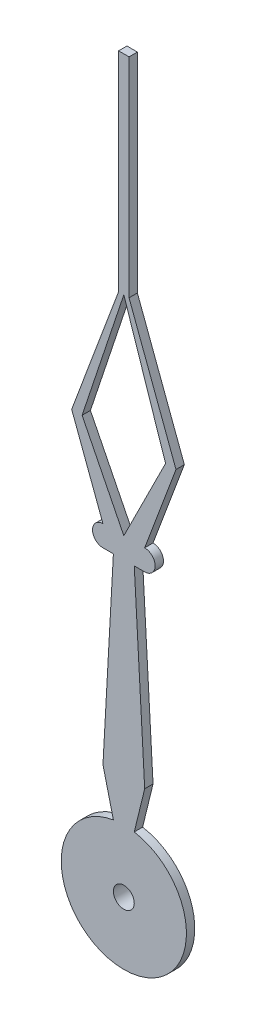
ISO-10303-21;
HEADER;
FILE_DESCRIPTION(('STEP AP214'),'2;1');
FILE_NAME('part.step','',(''),(''),'','','');
FILE_SCHEMA(('AUTOMOTIVE_DESIGN { 1 0 10303 214 1 1 1 1 }'));
ENDSEC;
DATA;
#1=APPLICATION_CONTEXT('core data for automotive mechanical design processes');
#2=APPLICATION_PROTOCOL_DEFINITION('international standard','automotive_design',2000,#1);
#3=PRODUCT_CONTEXT('',#1,'mechanical');
#4=PRODUCT('Part','Part','',(#3));
#5=PRODUCT_RELATED_PRODUCT_CATEGORY('part','',(#4));
#6=PRODUCT_DEFINITION_FORMATION('','',#4);
#7=PRODUCT_DEFINITION_CONTEXT('part definition',#1,'design');
#8=PRODUCT_DEFINITION('design','',#6,#7);
#9=PRODUCT_DEFINITION_SHAPE('','',#8);
#10=(LENGTH_UNIT() NAMED_UNIT(*) SI_UNIT(.MILLI.,.METRE.));
#11=(NAMED_UNIT(*) PLANE_ANGLE_UNIT() SI_UNIT($,.RADIAN.));
#12=(NAMED_UNIT(*) SI_UNIT($,.STERADIAN.) SOLID_ANGLE_UNIT());
#13=UNCERTAINTY_MEASURE_WITH_UNIT(LENGTH_MEASURE(1.E-05),#10,'distance_accuracy_value','');
#14=(GEOMETRIC_REPRESENTATION_CONTEXT(3) GLOBAL_UNCERTAINTY_ASSIGNED_CONTEXT((#13)) GLOBAL_UNIT_ASSIGNED_CONTEXT((#10,
#11,#12)) REPRESENTATION_CONTEXT('',''));
#15=CARTESIAN_POINT('',(0.,0.,0.));
#16=DIRECTION('',(0.,0.,1.));
#17=DIRECTION('',(1.,0.,0.));
#18=AXIS2_PLACEMENT_3D('',#15,#16,#17);
#19=CARTESIAN_POINT('',(0.,0.,0.));
#20=DIRECTION('',(0.,0.,1.));
#21=DIRECTION('',(1.,0.,0.));
#22=AXIS2_PLACEMENT_3D('',#19,#20,#21);
#23=PLANE('',#22);
#24=DIRECTION('',(0.447213595499958,0.894427190999916,0.));
#25=VECTOR('',#24,1.);
#26=CARTESIAN_POINT('',(0.,7.5,0.));
#27=LINE('',#26,#25);
#28=CARTESIAN_POINT('',(0.,7.5,0.));
#29=VERTEX_POINT('',#28);
#30=CARTESIAN_POINT('',(1.,9.5,0.));
#31=VERTEX_POINT('',#30);
#32=EDGE_CURVE('E59',#29,#31,#27,.T.);
#33=ORIENTED_EDGE('',*,*,#32,.T.);
#34=DIRECTION('',(-0.316227766016838,0.948683298050514,0.));
#35=VECTOR('',#34,1.);
#36=CARTESIAN_POINT('',(0.,12.5,0.));
#37=LINE('',#36,#35);
#38=CARTESIAN_POINT('',(0.,12.5,0.));
#39=VERTEX_POINT('',#38);
#40=EDGE_CURVE('E188',#31,#39,#37,.T.);
#41=ORIENTED_EDGE('',*,*,#40,.T.);
#42=DIRECTION('',(-0.316227766016838,-0.948683298050514,0.));
#43=VECTOR('',#42,1.);
#44=CARTESIAN_POINT('',(-1.,9.5,0.));
#45=LINE('',#44,#43);
#46=CARTESIAN_POINT('',(-1.,9.5,0.));
#47=VERTEX_POINT('',#46);
#48=EDGE_CURVE('E204',#39,#47,#45,.T.);
#49=ORIENTED_EDGE('',*,*,#48,.T.);
#50=DIRECTION('',(0.447213595499958,-0.894427190999916,0.));
#51=VECTOR('',#50,1.);
#52=CARTESIAN_POINT('',(0.,7.5,0.));
#53=LINE('',#52,#51);
#54=EDGE_CURVE('E182',#47,#29,#53,.T.);
#55=ORIENTED_EDGE('',*,*,#54,.T.);
#56=EDGE_LOOP('',(#33,#41,#49,#55));
#57=FACE_BOUND('',#56,.T.);
#58=CARTESIAN_POINT('',(0.,0.,0.));
#59=DIRECTION('',(0.,0.,1.));
#60=DIRECTION('',(1.,0.,0.));
#61=AXIS2_PLACEMENT_3D('',#58,#59,#60);
#62=CIRCLE('',#61,1.5);
#63=CARTESIAN_POINT('',(-0.25,1.4790199457749,0.));
#64=VERTEX_POINT('',#63);
#65=CARTESIAN_POINT('',(0.25,1.4790199457749,0.));
#66=VERTEX_POINT('',#65);
#67=EDGE_CURVE('E214',#64,#66,#62,.T.);
#68=ORIENTED_EDGE('',*,*,#67,.F.);
#69=DIRECTION('',(0.237836479973025,-0.97130520887826,0.));
#70=VECTOR('',#69,1.);
#71=CARTESIAN_POINT('',(-0.25,1.4790199457749,0.));
#72=LINE('',#71,#70);
#73=CARTESIAN_POINT('',(-0.5,2.5,0.));
#74=VERTEX_POINT('',#73);
#75=EDGE_CURVE('E219',#74,#64,#72,.T.);
#76=ORIENTED_EDGE('',*,*,#75,.F.);
#77=DIRECTION('',(-0.055470019622523,-0.998460353205412,0.));
#78=VECTOR('',#77,1.);
#79=CARTESIAN_POINT('',(-0.5,2.5,0.));
#80=LINE('',#79,#78);
#81=CARTESIAN_POINT('',(-0.25,7.,0.));
#82=VERTEX_POINT('',#81);
#83=EDGE_CURVE('E278',#82,#74,#80,.T.);
#84=ORIENTED_EDGE('',*,*,#83,.F.);
#85=DIRECTION('',(1.,0.,0.));
#86=VECTOR('',#85,1.);
#87=CARTESIAN_POINT('',(-0.5,7.,0.));
#88=LINE('',#87,#86);
#89=CARTESIAN_POINT('',(-0.5,7.,0.));
#90=VERTEX_POINT('',#89);
#91=EDGE_CURVE('E276',#90,#82,#88,.T.);
#92=ORIENTED_EDGE('',*,*,#91,.F.);
#93=CARTESIAN_POINT('',(-0.5,7.25,0.));
#94=DIRECTION('',(0.,0.,1.));
#95=DIRECTION('',(-1.,0.,0.));
#96=AXIS2_PLACEMENT_3D('',#93,#94,#95);
#97=CIRCLE('',#96,0.25);
#98=CARTESIAN_POINT('',(-0.5,7.5,0.));
#99=VERTEX_POINT('',#98);
#100=EDGE_CURVE('E274',#99,#90,#97,.T.);
#101=ORIENTED_EDGE('',*,*,#100,.F.);
#102=DIRECTION('',(0.351123441588392,-0.936329177569044,0.));
#103=VECTOR('',#102,1.);
#104=CARTESIAN_POINT('',(-0.5,7.5,0.));
#105=LINE('',#104,#103);
#106=CARTESIAN_POINT('',(-1.25,9.5,0.));
#107=VERTEX_POINT('',#106);
#108=EDGE_CURVE('E272',#107,#99,#105,.T.);
#109=ORIENTED_EDGE('',*,*,#108,.F.);
#110=DIRECTION('',(-0.351123441588392,-0.936329177569044,0.));
#111=VECTOR('',#110,1.);
#112=CARTESIAN_POINT('',(-1.25,9.5,0.));
#113=LINE('',#112,#111);
#114=CARTESIAN_POINT('',(-0.125,12.5,0.));
#115=VERTEX_POINT('',#114);
#116=EDGE_CURVE('E270',#115,#107,#113,.T.);
#117=ORIENTED_EDGE('',*,*,#116,.F.);
#118=DIRECTION('',(0.,-1.,0.));
#119=VECTOR('',#118,1.);
#120=CARTESIAN_POINT('',(-0.125000000000001,17.5,0.));
#121=LINE('',#120,#119);
#122=CARTESIAN_POINT('',(-0.125000000000001,17.5,0.));
#123=VERTEX_POINT('',#122);
#124=EDGE_CURVE('E268',#123,#115,#121,.T.);
#125=ORIENTED_EDGE('',*,*,#124,.F.);
#126=DIRECTION('',(-1.,0.,0.));
#127=VECTOR('',#126,1.);
#128=CARTESIAN_POINT('',(0.125,17.5,0.));
#129=LINE('',#128,#127);
#130=CARTESIAN_POINT('',(0.125,17.5,0.));
#131=VERTEX_POINT('',#130);
#132=EDGE_CURVE('E266',#131,#123,#129,.T.);
#133=ORIENTED_EDGE('',*,*,#132,.F.);
#134=DIRECTION('',(0.,1.,0.));
#135=VECTOR('',#134,1.);
#136=CARTESIAN_POINT('',(0.125,12.5,0.));
#137=LINE('',#136,#135);
#138=CARTESIAN_POINT('',(0.125,12.5,0.));
#139=VERTEX_POINT('',#138);
#140=EDGE_CURVE('E264',#139,#131,#137,.T.);
#141=ORIENTED_EDGE('',*,*,#140,.F.);
#142=DIRECTION('',(-0.351123441588392,0.936329177569044,0.));
#143=VECTOR('',#142,1.);
#144=CARTESIAN_POINT('',(1.25,9.5,0.));
#145=LINE('',#144,#143);
#146=CARTESIAN_POINT('',(1.25,9.5,0.));
#147=VERTEX_POINT('',#146);
#148=EDGE_CURVE('E262',#147,#139,#145,.T.);
#149=ORIENTED_EDGE('',*,*,#148,.F.);
#150=DIRECTION('',(0.351123441588392,0.936329177569044,0.));
#151=VECTOR('',#150,1.);
#152=CARTESIAN_POINT('',(0.5,7.5,0.));
#153=LINE('',#152,#151);
#154=CARTESIAN_POINT('',(0.5,7.5,0.));
#155=VERTEX_POINT('',#154);
#156=EDGE_CURVE('E260',#155,#147,#153,.T.);
#157=ORIENTED_EDGE('',*,*,#156,.F.);
#158=CARTESIAN_POINT('',(0.5,7.25,0.));
#159=DIRECTION('',(0.,0.,1.));
#160=DIRECTION('',(1.,0.,0.));
#161=AXIS2_PLACEMENT_3D('',#158,#159,#160);
#162=CIRCLE('',#161,0.250000000000001);
#163=CARTESIAN_POINT('',(0.5,7.,0.));
#164=VERTEX_POINT('',#163);
#165=EDGE_CURVE('E258',#164,#155,#162,.T.);
#166=ORIENTED_EDGE('',*,*,#165,.F.);
#167=DIRECTION('',(1.,0.,0.));
#168=VECTOR('',#167,1.);
#169=CARTESIAN_POINT('',(0.25,7.,0.));
#170=LINE('',#169,#168);
#171=CARTESIAN_POINT('',(0.25,7.,0.));
#172=VERTEX_POINT('',#171);
#173=EDGE_CURVE('E256',#172,#164,#170,.T.);
#174=ORIENTED_EDGE('',*,*,#173,.F.);
#175=DIRECTION('',(-0.0554700196225229,0.998460353205412,0.));
#176=VECTOR('',#175,1.);
#177=CARTESIAN_POINT('',(0.25,7.,0.));
#178=LINE('',#177,#176);
#179=CARTESIAN_POINT('',(0.5,2.5,0.));
#180=VERTEX_POINT('',#179);
#181=EDGE_CURVE('E254',#180,#172,#178,.T.);
#182=ORIENTED_EDGE('',*,*,#181,.F.);
#183=DIRECTION('',(0.237836479973025,0.97130520887826,0.));
#184=VECTOR('',#183,1.);
#185=CARTESIAN_POINT('',(0.5,2.5,0.));
#186=LINE('',#185,#184);
#187=EDGE_CURVE('E252',#66,#180,#186,.T.);
#188=ORIENTED_EDGE('',*,*,#187,.F.);
#189=EDGE_LOOP('',(#68,#76,#84,#92,#101,#109,#117,#125,#133,#141,#149,#157,#166,#174,#182,#188));
#190=FACE_BOUND('',#189,.T.);
#191=CARTESIAN_POINT('',(0.,0.,0.));
#192=DIRECTION('',(0.,0.,1.));
#193=DIRECTION('',(1.,0.,0.));
#194=AXIS2_PLACEMENT_3D('',#191,#192,#193);
#195=CIRCLE('',#194,0.5);
#196=CARTESIAN_POINT('',(0.5,0.,0.));
#197=VERTEX_POINT('',#196);
#198=EDGE_CURVE('E11',#197,#197,#195,.F.);
#199=ORIENTED_EDGE('',*,*,#198,.F.);
#200=EDGE_LOOP('',(#199));
#201=FACE_BOUND('',#200,.T.);
#202=ADVANCED_FACE('F36',(#57,#190,#201),#23,.F.);
#203=CARTESIAN_POINT('',(0.,0.,0.2));
#204=DIRECTION('',(0.,0.,1.));
#205=DIRECTION('',(1.,0.,0.));
#206=AXIS2_PLACEMENT_3D('',#203,#204,#205);
#207=PLANE('',#206);
#208=CARTESIAN_POINT('',(0.,0.,0.2));
#209=DIRECTION('',(0.,0.,1.));
#210=DIRECTION('',(1.,0.,0.));
#211=AXIS2_PLACEMENT_3D('',#208,#209,#210);
#212=CIRCLE('',#211,0.25);
#213=CARTESIAN_POINT('',(0.25,0.,0.2));
#214=VERTEX_POINT('',#213);
#215=EDGE_CURVE('E189',#214,#214,#212,.T.);
#216=ORIENTED_EDGE('',*,*,#215,.F.);
#217=EDGE_LOOP('',(#216));
#218=FACE_BOUND('',#217,.T.);
#219=CARTESIAN_POINT('',(0.,0.,0.2));
#220=DIRECTION('',(0.,0.,1.));
#221=DIRECTION('',(1.,0.,0.));
#222=AXIS2_PLACEMENT_3D('',#219,#220,#221);
#223=CIRCLE('',#222,1.5);
#224=CARTESIAN_POINT('',(-0.25,1.4790199457749,0.2));
#225=VERTEX_POINT('',#224);
#226=CARTESIAN_POINT('',(0.25,1.4790199457749,0.2));
#227=VERTEX_POINT('',#226);
#228=EDGE_CURVE('E215',#225,#227,#223,.T.);
#229=ORIENTED_EDGE('',*,*,#228,.T.);
#230=DIRECTION('',(0.237836479973025,0.97130520887826,0.));
#231=VECTOR('',#230,1.);
#232=CARTESIAN_POINT('',(0.5,2.5,0.2));
#233=LINE('',#232,#231);
#234=CARTESIAN_POINT('',(0.5,2.5,0.2));
#235=VERTEX_POINT('',#234);
#236=EDGE_CURVE('E218',#227,#235,#233,.T.);
#237=ORIENTED_EDGE('',*,*,#236,.T.);
#238=DIRECTION('',(-0.0554700196225229,0.998460353205412,0.));
#239=VECTOR('',#238,1.);
#240=CARTESIAN_POINT('',(0.25,7.,0.2));
#241=LINE('',#240,#239);
#242=CARTESIAN_POINT('',(0.25,7.,0.2));
#243=VERTEX_POINT('',#242);
#244=EDGE_CURVE('E221',#235,#243,#241,.T.);
#245=ORIENTED_EDGE('',*,*,#244,.T.);
#246=DIRECTION('',(1.,0.,0.));
#247=VECTOR('',#246,1.);
#248=CARTESIAN_POINT('',(0.25,7.,0.2));
#249=LINE('',#248,#247);
#250=CARTESIAN_POINT('',(0.5,7.,0.2));
#251=VERTEX_POINT('',#250);
#252=EDGE_CURVE('E223',#243,#251,#249,.T.);
#253=ORIENTED_EDGE('',*,*,#252,.T.);
#254=CARTESIAN_POINT('',(0.5,7.25,0.2));
#255=DIRECTION('',(0.,0.,1.));
#256=DIRECTION('',(1.,0.,0.));
#257=AXIS2_PLACEMENT_3D('',#254,#255,#256);
#258=CIRCLE('',#257,0.250000000000001);
#259=CARTESIAN_POINT('',(0.5,7.5,0.2));
#260=VERTEX_POINT('',#259);
#261=EDGE_CURVE('E225',#251,#260,#258,.T.);
#262=ORIENTED_EDGE('',*,*,#261,.T.);
#263=DIRECTION('',(0.351123441588392,0.936329177569044,0.));
#264=VECTOR('',#263,1.);
#265=CARTESIAN_POINT('',(0.5,7.5,0.2));
#266=LINE('',#265,#264);
#267=CARTESIAN_POINT('',(1.25,9.5,0.2));
#268=VERTEX_POINT('',#267);
#269=EDGE_CURVE('E227',#260,#268,#266,.T.);
#270=ORIENTED_EDGE('',*,*,#269,.T.);
#271=DIRECTION('',(-0.351123441588392,0.936329177569044,0.));
#272=VECTOR('',#271,1.);
#273=CARTESIAN_POINT('',(1.25,9.5,0.2));
#274=LINE('',#273,#272);
#275=CARTESIAN_POINT('',(0.125,12.5,0.2));
#276=VERTEX_POINT('',#275);
#277=EDGE_CURVE('E229',#268,#276,#274,.T.);
#278=ORIENTED_EDGE('',*,*,#277,.T.);
#279=DIRECTION('',(0.,1.,0.));
#280=VECTOR('',#279,1.);
#281=CARTESIAN_POINT('',(0.125,12.5,0.2));
#282=LINE('',#281,#280);
#283=CARTESIAN_POINT('',(0.125,17.5,0.2));
#284=VERTEX_POINT('',#283);
#285=EDGE_CURVE('E231',#276,#284,#282,.T.);
#286=ORIENTED_EDGE('',*,*,#285,.T.);
#287=DIRECTION('',(-1.,0.,0.));
#288=VECTOR('',#287,1.);
#289=CARTESIAN_POINT('',(0.125,17.5,0.2));
#290=LINE('',#289,#288);
#291=CARTESIAN_POINT('',(-0.125000000000001,17.5,0.2));
#292=VERTEX_POINT('',#291);
#293=EDGE_CURVE('E233',#284,#292,#290,.T.);
#294=ORIENTED_EDGE('',*,*,#293,.T.);
#295=DIRECTION('',(0.,-1.,0.));
#296=VECTOR('',#295,1.);
#297=CARTESIAN_POINT('',(-0.125000000000001,17.5,0.2));
#298=LINE('',#297,#296);
#299=CARTESIAN_POINT('',(-0.125,12.5,0.2));
#300=VERTEX_POINT('',#299);
#301=EDGE_CURVE('E235',#292,#300,#298,.T.);
#302=ORIENTED_EDGE('',*,*,#301,.T.);
#303=DIRECTION('',(-0.351123441588392,-0.936329177569044,0.));
#304=VECTOR('',#303,1.);
#305=CARTESIAN_POINT('',(-1.25,9.5,0.2));
#306=LINE('',#305,#304);
#307=CARTESIAN_POINT('',(-1.25,9.5,0.2));
#308=VERTEX_POINT('',#307);
#309=EDGE_CURVE('E237',#300,#308,#306,.T.);
#310=ORIENTED_EDGE('',*,*,#309,.T.);
#311=DIRECTION('',(0.351123441588392,-0.936329177569044,0.));
#312=VECTOR('',#311,1.);
#313=CARTESIAN_POINT('',(-0.5,7.5,0.2));
#314=LINE('',#313,#312);
#315=CARTESIAN_POINT('',(-0.5,7.5,0.2));
#316=VERTEX_POINT('',#315);
#317=EDGE_CURVE('E239',#308,#316,#314,.T.);
#318=ORIENTED_EDGE('',*,*,#317,.T.);
#319=CARTESIAN_POINT('',(-0.5,7.25,0.2));
#320=DIRECTION('',(0.,0.,1.));
#321=DIRECTION('',(-1.,0.,0.));
#322=AXIS2_PLACEMENT_3D('',#319,#320,#321);
#323=CIRCLE('',#322,0.25);
#324=CARTESIAN_POINT('',(-0.5,7.,0.2));
#325=VERTEX_POINT('',#324);
#326=EDGE_CURVE('E241',#316,#325,#323,.T.);
#327=ORIENTED_EDGE('',*,*,#326,.T.);
#328=DIRECTION('',(1.,0.,0.));
#329=VECTOR('',#328,1.);
#330=CARTESIAN_POINT('',(-0.5,7.,0.2));
#331=LINE('',#330,#329);
#332=CARTESIAN_POINT('',(-0.25,7.,0.2));
#333=VERTEX_POINT('',#332);
#334=EDGE_CURVE('E243',#325,#333,#331,.T.);
#335=ORIENTED_EDGE('',*,*,#334,.T.);
#336=DIRECTION('',(-0.055470019622523,-0.998460353205412,0.));
#337=VECTOR('',#336,1.);
#338=CARTESIAN_POINT('',(-0.5,2.5,0.2));
#339=LINE('',#338,#337);
#340=CARTESIAN_POINT('',(-0.5,2.5,0.2));
#341=VERTEX_POINT('',#340);
#342=EDGE_CURVE('E245',#333,#341,#339,.T.);
#343=ORIENTED_EDGE('',*,*,#342,.T.);
#344=DIRECTION('',(0.237836479973025,-0.97130520887826,0.));
#345=VECTOR('',#344,1.);
#346=CARTESIAN_POINT('',(-0.25,1.4790199457749,0.2));
#347=LINE('',#346,#345);
#348=EDGE_CURVE('E247',#341,#225,#347,.T.);
#349=ORIENTED_EDGE('',*,*,#348,.T.);
#350=EDGE_LOOP('',(#229,#237,#245,#253,#262,#270,#278,#286,#294,#302,#310,#318,#327,#335,#343,#349));
#351=FACE_BOUND('',#350,.T.);
#352=DIRECTION('',(-0.316227766016838,0.948683298050514,0.));
#353=VECTOR('',#352,1.);
#354=CARTESIAN_POINT('',(0.,12.5,0.2));
#355=LINE('',#354,#353);
#356=CARTESIAN_POINT('',(1.,9.5,0.2));
#357=VERTEX_POINT('',#356);
#358=CARTESIAN_POINT('',(0.,12.5,0.2));
#359=VERTEX_POINT('',#358);
#360=EDGE_CURVE('E181',#357,#359,#355,.T.);
#361=ORIENTED_EDGE('',*,*,#360,.F.);
#362=DIRECTION('',(0.447213595499958,0.894427190999916,0.));
#363=VECTOR('',#362,1.);
#364=CARTESIAN_POINT('',(0.,7.5,0.2));
#365=LINE('',#364,#363);
#366=CARTESIAN_POINT('',(0.,7.5,0.2));
#367=VERTEX_POINT('',#366);
#368=EDGE_CURVE('E173',#367,#357,#365,.T.);
#369=ORIENTED_EDGE('',*,*,#368,.F.);
#370=DIRECTION('',(0.447213595499958,-0.894427190999916,0.));
#371=VECTOR('',#370,1.);
#372=CARTESIAN_POINT('',(0.,7.5,0.2));
#373=LINE('',#372,#371);
#374=CARTESIAN_POINT('',(-1.,9.5,0.2));
#375=VERTEX_POINT('',#374);
#376=EDGE_CURVE('E196',#375,#367,#373,.T.);
#377=ORIENTED_EDGE('',*,*,#376,.F.);
#378=DIRECTION('',(-0.316227766016838,-0.948683298050514,0.));
#379=VECTOR('',#378,1.);
#380=CARTESIAN_POINT('',(-1.,9.5,0.2));
#381=LINE('',#380,#379);
#382=EDGE_CURVE('E194',#359,#375,#381,.T.);
#383=ORIENTED_EDGE('',*,*,#382,.F.);
#384=EDGE_LOOP('',(#361,#369,#377,#383));
#385=FACE_BOUND('',#384,.T.);
#386=ADVANCED_FACE('F193',(#218,#351,#385),#207,.T.);
#387=CARTESIAN_POINT('',(0.,0.,0.2));
#388=DIRECTION('',(0.,0.,-1.));
#389=DIRECTION('',(-1.,0.,0.));
#390=AXIS2_PLACEMENT_3D('',#387,#388,#389);
#391=CYLINDRICAL_SURFACE('',#390,1.5);
#392=ORIENTED_EDGE('',*,*,#67,.T.);
#393=DIRECTION('',(0.,0.,-1.));
#394=VECTOR('',#393,1.);
#395=CARTESIAN_POINT('',(0.25,1.4790199457749,0.2));
#396=LINE('',#395,#394);
#397=EDGE_CURVE('E44',#227,#66,#396,.T.);
#398=ORIENTED_EDGE('',*,*,#397,.F.);
#399=ORIENTED_EDGE('',*,*,#228,.F.);
#400=DIRECTION('',(0.,0.,-1.));
#401=VECTOR('',#400,1.);
#402=CARTESIAN_POINT('',(-0.25,1.4790199457749,0.2));
#403=LINE('',#402,#401);
#404=EDGE_CURVE('E249',#225,#64,#403,.T.);
#405=ORIENTED_EDGE('',*,*,#404,.T.);
#406=EDGE_LOOP('',(#392,#398,#399,#405));
#407=FACE_BOUND('',#406,.T.);
#408=ADVANCED_FACE('F38',(#407),#391,.T.);
#409=CARTESIAN_POINT('',(0.5,2.5,0.2));
#410=DIRECTION('',(-0.97130520887826,0.237836479973025,0.));
#411=DIRECTION('',(-0.237836479973025,-0.971305208878261,0.));
#412=AXIS2_PLACEMENT_3D('',#409,#410,#411);
#413=PLANE('',#412);
#414=ORIENTED_EDGE('',*,*,#187,.T.);
#415=DIRECTION('',(0.,0.,-1.));
#416=VECTOR('',#415,1.);
#417=CARTESIAN_POINT('',(0.5,2.5,0.2));
#418=LINE('',#417,#416);
#419=EDGE_CURVE('E322',#235,#180,#418,.T.);
#420=ORIENTED_EDGE('',*,*,#419,.F.);
#421=ORIENTED_EDGE('',*,*,#236,.F.);
#422=ORIENTED_EDGE('',*,*,#397,.T.);
#423=EDGE_LOOP('',(#414,#420,#421,#422));
#424=FACE_BOUND('',#423,.T.);
#425=ADVANCED_FACE('F327',(#424),#413,.F.);
#426=CARTESIAN_POINT('',(0.25,7.,0.2));
#427=DIRECTION('',(-0.998460353205412,-0.0554700196225229,0.));
#428=DIRECTION('',(0.0554700196225229,-0.998460353205412,0.));
#429=AXIS2_PLACEMENT_3D('',#426,#427,#428);
#430=PLANE('',#429);
#431=ORIENTED_EDGE('',*,*,#181,.T.);
#432=DIRECTION('',(0.,0.,-1.));
#433=VECTOR('',#432,1.);
#434=CARTESIAN_POINT('',(0.25,7.,0.2));
#435=LINE('',#434,#433);
#436=EDGE_CURVE('E319',#243,#172,#435,.T.);
#437=ORIENTED_EDGE('',*,*,#436,.F.);
#438=ORIENTED_EDGE('',*,*,#244,.F.);
#439=ORIENTED_EDGE('',*,*,#419,.T.);
#440=EDGE_LOOP('',(#431,#437,#438,#439));
#441=FACE_BOUND('',#440,.T.);
#442=ADVANCED_FACE('F342',(#441),#430,.F.);
#443=CARTESIAN_POINT('',(0.25,7.,0.2));
#444=DIRECTION('',(0.,1.,0.));
#445=DIRECTION('',(-1.,0.,0.));
#446=AXIS2_PLACEMENT_3D('',#443,#444,#445);
#447=PLANE('',#446);
#448=ORIENTED_EDGE('',*,*,#173,.T.);
#449=DIRECTION('',(0.,0.,-1.));
#450=VECTOR('',#449,1.);
#451=CARTESIAN_POINT('',(0.5,7.,0.2));
#452=LINE('',#451,#450);
#453=EDGE_CURVE('E316',#251,#164,#452,.T.);
#454=ORIENTED_EDGE('',*,*,#453,.F.);
#455=ORIENTED_EDGE('',*,*,#252,.F.);
#456=ORIENTED_EDGE('',*,*,#436,.T.);
#457=EDGE_LOOP('',(#448,#454,#455,#456));
#458=FACE_BOUND('',#457,.T.);
#459=ADVANCED_FACE('F346',(#458),#447,.F.);
#460=CARTESIAN_POINT('',(0.5,7.25,0.2));
#461=DIRECTION('',(0.,0.,-1.));
#462=DIRECTION('',(-1.,0.,0.));
#463=AXIS2_PLACEMENT_3D('',#460,#461,#462);
#464=CYLINDRICAL_SURFACE('',#463,0.250000000000001);
#465=ORIENTED_EDGE('',*,*,#165,.T.);
#466=DIRECTION('',(0.,0.,-1.));
#467=VECTOR('',#466,1.);
#468=CARTESIAN_POINT('',(0.5,7.5,0.2));
#469=LINE('',#468,#467);
#470=EDGE_CURVE('E313',#260,#155,#469,.T.);
#471=ORIENTED_EDGE('',*,*,#470,.F.);
#472=ORIENTED_EDGE('',*,*,#261,.F.);
#473=ORIENTED_EDGE('',*,*,#453,.T.);
#474=EDGE_LOOP('',(#465,#471,#472,#473));
#475=FACE_BOUND('',#474,.T.);
#476=ADVANCED_FACE('F404',(#475),#464,.T.);
#477=CARTESIAN_POINT('',(0.5,7.5,0.2));
#478=DIRECTION('',(-0.936329177569044,0.351123441588392,0.));
#479=DIRECTION('',(-0.351123441588392,-0.936329177569045,0.));
#480=AXIS2_PLACEMENT_3D('',#477,#478,#479);
#481=PLANE('',#480);
#482=ORIENTED_EDGE('',*,*,#156,.T.);
#483=DIRECTION('',(0.,0.,-1.));
#484=VECTOR('',#483,1.);
#485=CARTESIAN_POINT('',(1.25,9.5,0.2));
#486=LINE('',#485,#484);
#487=EDGE_CURVE('E310',#268,#147,#486,.T.);
#488=ORIENTED_EDGE('',*,*,#487,.F.);
#489=ORIENTED_EDGE('',*,*,#269,.F.);
#490=ORIENTED_EDGE('',*,*,#470,.T.);
#491=EDGE_LOOP('',(#482,#488,#489,#490));
#492=FACE_BOUND('',#491,.T.);
#493=ADVANCED_FACE('F402',(#492),#481,.F.);
#494=CARTESIAN_POINT('',(1.25,9.5,0.2));
#495=DIRECTION('',(-0.936329177569045,-0.351123441588392,0.));
#496=DIRECTION('',(0.351123441588392,-0.936329177569045,0.));
#497=AXIS2_PLACEMENT_3D('',#494,#495,#496);
#498=PLANE('',#497);
#499=ORIENTED_EDGE('',*,*,#148,.T.);
#500=DIRECTION('',(0.,0.,-1.));
#501=VECTOR('',#500,1.);
#502=CARTESIAN_POINT('',(0.125,12.5,0.2));
#503=LINE('',#502,#501);
#504=EDGE_CURVE('E307',#276,#139,#503,.T.);
#505=ORIENTED_EDGE('',*,*,#504,.F.);
#506=ORIENTED_EDGE('',*,*,#277,.F.);
#507=ORIENTED_EDGE('',*,*,#487,.T.);
#508=EDGE_LOOP('',(#499,#505,#506,#507));
#509=FACE_BOUND('',#508,.T.);
#510=ADVANCED_FACE('F398',(#509),#498,.F.);
#511=CARTESIAN_POINT('',(0.125,12.5,0.2));
#512=DIRECTION('',(-1.,0.,0.));
#513=DIRECTION('',(0.,0.,1.));
#514=AXIS2_PLACEMENT_3D('',#511,#512,#513);
#515=PLANE('',#514);
#516=ORIENTED_EDGE('',*,*,#140,.T.);
#517=DIRECTION('',(0.,0.,-1.));
#518=VECTOR('',#517,1.);
#519=CARTESIAN_POINT('',(0.125,17.5,0.2));
#520=LINE('',#519,#518);
#521=EDGE_CURVE('E304',#284,#131,#520,.T.);
#522=ORIENTED_EDGE('',*,*,#521,.F.);
#523=ORIENTED_EDGE('',*,*,#285,.F.);
#524=ORIENTED_EDGE('',*,*,#504,.T.);
#525=EDGE_LOOP('',(#516,#522,#523,#524));
#526=FACE_BOUND('',#525,.T.);
#527=ADVANCED_FACE('F393',(#526),#515,.F.);
#528=CARTESIAN_POINT('',(0.125,17.5,0.2));
#529=DIRECTION('',(0.,-1.,0.));
#530=DIRECTION('',(0.,0.,-1.));
#531=AXIS2_PLACEMENT_3D('',#528,#529,#530);
#532=PLANE('',#531);
#533=ORIENTED_EDGE('',*,*,#132,.T.);
#534=DIRECTION('',(0.,0.,-1.));
#535=VECTOR('',#534,1.);
#536=CARTESIAN_POINT('',(-0.125000000000001,17.5,0.2));
#537=LINE('',#536,#535);
#538=EDGE_CURVE('E301',#292,#123,#537,.T.);
#539=ORIENTED_EDGE('',*,*,#538,.F.);
#540=ORIENTED_EDGE('',*,*,#293,.F.);
#541=ORIENTED_EDGE('',*,*,#521,.T.);
#542=EDGE_LOOP('',(#533,#539,#540,#541));
#543=FACE_BOUND('',#542,.T.);
#544=ADVANCED_FACE('F387',(#543),#532,.F.);
#545=CARTESIAN_POINT('',(-0.125000000000001,17.5,0.2));
#546=DIRECTION('',(1.,0.,0.));
#547=DIRECTION('',(0.,1.,0.));
#548=AXIS2_PLACEMENT_3D('',#545,#546,#547);
#549=PLANE('',#548);
#550=ORIENTED_EDGE('',*,*,#124,.T.);
#551=DIRECTION('',(0.,0.,-1.));
#552=VECTOR('',#551,1.);
#553=CARTESIAN_POINT('',(-0.125,12.5,0.2));
#554=LINE('',#553,#552);
#555=EDGE_CURVE('E298',#300,#115,#554,.T.);
#556=ORIENTED_EDGE('',*,*,#555,.F.);
#557=ORIENTED_EDGE('',*,*,#301,.F.);
#558=ORIENTED_EDGE('',*,*,#538,.T.);
#559=EDGE_LOOP('',(#550,#556,#557,#558));
#560=FACE_BOUND('',#559,.T.);
#561=ADVANCED_FACE('F383',(#560),#549,.F.);
#562=CARTESIAN_POINT('',(-1.25,9.5,0.2));
#563=DIRECTION('',(0.936329177569045,-0.351123441588392,0.));
#564=DIRECTION('',(0.351123441588392,0.936329177569045,0.));
#565=AXIS2_PLACEMENT_3D('',#562,#563,#564);
#566=PLANE('',#565);
#567=ORIENTED_EDGE('',*,*,#116,.T.);
#568=DIRECTION('',(0.,0.,-1.));
#569=VECTOR('',#568,1.);
#570=CARTESIAN_POINT('',(-1.25,9.5,0.2));
#571=LINE('',#570,#569);
#572=EDGE_CURVE('E295',#308,#107,#571,.T.);
#573=ORIENTED_EDGE('',*,*,#572,.F.);
#574=ORIENTED_EDGE('',*,*,#309,.F.);
#575=ORIENTED_EDGE('',*,*,#555,.T.);
#576=EDGE_LOOP('',(#567,#573,#574,#575));
#577=FACE_BOUND('',#576,.T.);
#578=ADVANCED_FACE('F378',(#577),#566,.F.);
#579=CARTESIAN_POINT('',(-0.5,7.5,0.2));
#580=DIRECTION('',(0.936329177569045,0.351123441588392,0.));
#581=DIRECTION('',(-0.351123441588392,0.936329177569045,0.));
#582=AXIS2_PLACEMENT_3D('',#579,#580,#581);
#583=PLANE('',#582);
#584=ORIENTED_EDGE('',*,*,#108,.T.);
#585=DIRECTION('',(0.,0.,-1.));
#586=VECTOR('',#585,1.);
#587=CARTESIAN_POINT('',(-0.5,7.5,0.2));
#588=LINE('',#587,#586);
#589=EDGE_CURVE('E292',#316,#99,#588,.T.);
#590=ORIENTED_EDGE('',*,*,#589,.F.);
#591=ORIENTED_EDGE('',*,*,#317,.F.);
#592=ORIENTED_EDGE('',*,*,#572,.T.);
#593=EDGE_LOOP('',(#584,#590,#591,#592));
#594=FACE_BOUND('',#593,.T.);
#595=ADVANCED_FACE('F372',(#594),#583,.F.);
#596=CARTESIAN_POINT('',(-0.5,7.25,0.2));
#597=DIRECTION('',(0.,0.,-1.));
#598=DIRECTION('',(-1.,0.,0.));
#599=AXIS2_PLACEMENT_3D('',#596,#597,#598);
#600=CYLINDRICAL_SURFACE('',#599,0.25);
#601=ORIENTED_EDGE('',*,*,#100,.T.);
#602=DIRECTION('',(0.,0.,-1.));
#603=VECTOR('',#602,1.);
#604=CARTESIAN_POINT('',(-0.5,7.,0.2));
#605=LINE('',#604,#603);
#606=EDGE_CURVE('E289',#325,#90,#605,.T.);
#607=ORIENTED_EDGE('',*,*,#606,.F.);
#608=ORIENTED_EDGE('',*,*,#326,.F.);
#609=ORIENTED_EDGE('',*,*,#589,.T.);
#610=EDGE_LOOP('',(#601,#607,#608,#609));
#611=FACE_BOUND('',#610,.T.);
#612=ADVANCED_FACE('F368',(#611),#600,.T.);
#613=CARTESIAN_POINT('',(-0.5,7.,0.2));
#614=DIRECTION('',(0.,1.,0.));
#615=DIRECTION('',(0.,0.,1.));
#616=AXIS2_PLACEMENT_3D('',#613,#614,#615);
#617=PLANE('',#616);
#618=ORIENTED_EDGE('',*,*,#91,.T.);
#619=DIRECTION('',(0.,0.,-1.));
#620=VECTOR('',#619,1.);
#621=CARTESIAN_POINT('',(-0.25,7.,0.2));
#622=LINE('',#621,#620);
#623=EDGE_CURVE('E286',#333,#82,#622,.T.);
#624=ORIENTED_EDGE('',*,*,#623,.F.);
#625=ORIENTED_EDGE('',*,*,#334,.F.);
#626=ORIENTED_EDGE('',*,*,#606,.T.);
#627=EDGE_LOOP('',(#618,#624,#625,#626));
#628=FACE_BOUND('',#627,.T.);
#629=ADVANCED_FACE('F363',(#628),#617,.F.);
#630=CARTESIAN_POINT('',(-0.5,2.5,0.2));
#631=DIRECTION('',(0.998460353205412,-0.055470019622523,0.));
#632=DIRECTION('',(0.055470019622523,0.998460353205412,0.));
#633=AXIS2_PLACEMENT_3D('',#630,#631,#632);
#634=PLANE('',#633);
#635=ORIENTED_EDGE('',*,*,#83,.T.);
#636=DIRECTION('',(0.,0.,-1.));
#637=VECTOR('',#636,1.);
#638=CARTESIAN_POINT('',(-0.5,2.5,0.2));
#639=LINE('',#638,#637);
#640=EDGE_CURVE('E283',#341,#74,#639,.T.);
#641=ORIENTED_EDGE('',*,*,#640,.F.);
#642=ORIENTED_EDGE('',*,*,#342,.F.);
#643=ORIENTED_EDGE('',*,*,#623,.T.);
#644=EDGE_LOOP('',(#635,#641,#642,#643));
#645=FACE_BOUND('',#644,.T.);
#646=ADVANCED_FACE('F357',(#645),#634,.F.);
#647=CARTESIAN_POINT('',(-0.25,1.4790199457749,0.2));
#648=DIRECTION('',(0.97130520887826,0.237836479973025,0.));
#649=DIRECTION('',(-0.237836479973025,0.97130520887826,0.));
#650=AXIS2_PLACEMENT_3D('',#647,#648,#649);
#651=PLANE('',#650);
#652=ORIENTED_EDGE('',*,*,#75,.T.);
#653=ORIENTED_EDGE('',*,*,#404,.F.);
#654=ORIENTED_EDGE('',*,*,#348,.F.);
#655=ORIENTED_EDGE('',*,*,#640,.T.);
#656=EDGE_LOOP('',(#652,#653,#654,#655));
#657=FACE_BOUND('',#656,.T.);
#658=ADVANCED_FACE('F355',(#657),#651,.F.);
#659=CARTESIAN_POINT('',(0.,0.,0.2));
#660=DIRECTION('',(0.,0.,-1.));
#661=DIRECTION('',(-1.,0.,0.));
#662=AXIS2_PLACEMENT_3D('',#659,#660,#661);
#663=CYLINDRICAL_SURFACE('',#662,0.25);
#664=ORIENTED_EDGE('',*,*,#215,.T.);
#665=EDGE_LOOP('',(#664));
#666=FACE_BOUND('',#665,.T.);
#667=CARTESIAN_POINT('',(0.,0.,-0.2));
#668=DIRECTION('',(0.,0.,-1.));
#669=DIRECTION('',(-1.,0.,0.));
#670=AXIS2_PLACEMENT_3D('',#667,#668,#669);
#671=CIRCLE('',#670,0.25);
#672=CARTESIAN_POINT('',(-0.25,0.,-0.2));
#673=VERTEX_POINT('',#672);
#674=EDGE_CURVE('E665',#673,#673,#671,.T.);
#675=ORIENTED_EDGE('',*,*,#674,.T.);
#676=EDGE_LOOP('',(#675));
#677=FACE_BOUND('',#676,.T.);
#678=ADVANCED_FACE('F425',(#666,#677),#663,.F.);
#679=CARTESIAN_POINT('',(0.,7.5,0.2));
#680=DIRECTION('',(-0.894427190999916,0.447213595499958,0.));
#681=DIRECTION('',(-0.447213595499958,-0.894427190999916,0.));
#682=AXIS2_PLACEMENT_3D('',#679,#680,#681);
#683=PLANE('',#682);
#684=ORIENTED_EDGE('',*,*,#32,.F.);
#685=DIRECTION('',(0.,0.,-1.));
#686=VECTOR('',#685,1.);
#687=CARTESIAN_POINT('',(0.,7.5,0.2));
#688=LINE('',#687,#686);
#689=EDGE_CURVE('E177',#367,#29,#688,.T.);
#690=ORIENTED_EDGE('',*,*,#689,.F.);
#691=ORIENTED_EDGE('',*,*,#368,.T.);
#692=DIRECTION('',(0.,0.,-1.));
#693=VECTOR('',#692,1.);
#694=CARTESIAN_POINT('',(1.,9.5,0.2));
#695=LINE('',#694,#693);
#696=EDGE_CURVE('E176',#357,#31,#695,.T.);
#697=ORIENTED_EDGE('',*,*,#696,.T.);
#698=EDGE_LOOP('',(#684,#690,#691,#697));
#699=FACE_BOUND('',#698,.T.);
#700=ADVANCED_FACE('F175',(#699),#683,.T.);
#701=CARTESIAN_POINT('',(0.,12.5,0.2));
#702=DIRECTION('',(-0.948683298050514,-0.316227766016838,0.));
#703=DIRECTION('',(0.316227766016838,-0.948683298050514,0.));
#704=AXIS2_PLACEMENT_3D('',#701,#702,#703);
#705=PLANE('',#704);
#706=ORIENTED_EDGE('',*,*,#40,.F.);
#707=ORIENTED_EDGE('',*,*,#696,.F.);
#708=ORIENTED_EDGE('',*,*,#360,.T.);
#709=DIRECTION('',(0.,0.,-1.));
#710=VECTOR('',#709,1.);
#711=CARTESIAN_POINT('',(0.,12.5,0.2));
#712=LINE('',#711,#710);
#713=EDGE_CURVE('E190',#359,#39,#712,.T.);
#714=ORIENTED_EDGE('',*,*,#713,.T.);
#715=EDGE_LOOP('',(#706,#707,#708,#714));
#716=FACE_BOUND('',#715,.T.);
#717=ADVANCED_FACE('F185',(#716),#705,.T.);
#718=CARTESIAN_POINT('',(-1.,9.5,0.2));
#719=DIRECTION('',(0.948683298050514,-0.316227766016838,0.));
#720=DIRECTION('',(0.316227766016838,0.948683298050514,0.));
#721=AXIS2_PLACEMENT_3D('',#718,#719,#720);
#722=PLANE('',#721);
#723=ORIENTED_EDGE('',*,*,#48,.F.);
#724=ORIENTED_EDGE('',*,*,#713,.F.);
#725=ORIENTED_EDGE('',*,*,#382,.T.);
#726=DIRECTION('',(0.,0.,-1.));
#727=VECTOR('',#726,1.);
#728=CARTESIAN_POINT('',(-1.,9.5,0.2));
#729=LINE('',#728,#727);
#730=EDGE_CURVE('E51',#375,#47,#729,.T.);
#731=ORIENTED_EDGE('',*,*,#730,.T.);
#732=EDGE_LOOP('',(#723,#724,#725,#731));
#733=FACE_BOUND('',#732,.T.);
#734=ADVANCED_FACE('F506',(#733),#722,.T.);
#735=CARTESIAN_POINT('',(0.,7.5,0.2));
#736=DIRECTION('',(0.894427190999916,0.447213595499958,0.));
#737=DIRECTION('',(-0.447213595499958,0.894427190999916,0.));
#738=AXIS2_PLACEMENT_3D('',#735,#736,#737);
#739=PLANE('',#738);
#740=ORIENTED_EDGE('',*,*,#54,.F.);
#741=ORIENTED_EDGE('',*,*,#730,.F.);
#742=ORIENTED_EDGE('',*,*,#376,.T.);
#743=ORIENTED_EDGE('',*,*,#689,.T.);
#744=EDGE_LOOP('',(#740,#741,#742,#743));
#745=FACE_BOUND('',#744,.T.);
#746=ADVANCED_FACE('F512',(#745),#739,.T.);
#747=CARTESIAN_POINT('',(0.,0.,-0.2));
#748=DIRECTION('',(0.,0.,-1.));
#749=DIRECTION('',(-1.,0.,0.));
#750=AXIS2_PLACEMENT_3D('',#747,#748,#749);
#751=PLANE('',#750);
#752=CARTESIAN_POINT('',(0.,0.,-0.2));
#753=DIRECTION('',(0.,0.,-1.));
#754=DIRECTION('',(-1.,0.,0.));
#755=AXIS2_PLACEMENT_3D('',#752,#753,#754);
#756=CIRCLE('',#755,0.5);
#757=CARTESIAN_POINT('',(-0.5,0.,-0.2));
#758=VERTEX_POINT('',#757);
#759=EDGE_CURVE('E202',#758,#758,#756,.T.);
#760=ORIENTED_EDGE('',*,*,#759,.T.);
#761=EDGE_LOOP('',(#760));
#762=FACE_BOUND('',#761,.T.);
#763=ORIENTED_EDGE('',*,*,#674,.F.);
#764=EDGE_LOOP('',(#763));
#765=FACE_BOUND('',#764,.T.);
#766=ADVANCED_FACE('F519',(#762,#765),#751,.T.);
#767=CARTESIAN_POINT('',(0.,0.,-0.2));
#768=DIRECTION('',(0.,0.,1.));
#769=DIRECTION('',(1.,0.,0.));
#770=AXIS2_PLACEMENT_3D('',#767,#768,#769);
#771=CYLINDRICAL_SURFACE('',#770,0.5);
#772=ORIENTED_EDGE('',*,*,#759,.F.);
#773=EDGE_LOOP('',(#772));
#774=FACE_BOUND('',#773,.T.);
#775=ORIENTED_EDGE('',*,*,#198,.T.);
#776=EDGE_LOOP('',(#775));
#777=FACE_BOUND('',#776,.T.);
#778=ADVANCED_FACE('F527',(#774,#777),#771,.T.);
#779=CLOSED_SHELL('',(#202,#386,#408,#425,#442,#459,#476,#493,#510,#527,#544,#561,#578,#595,
#612,#629,#646,#658,#678,#700,#717,#734,#746,#766,#778));
#780=MANIFOLD_SOLID_BREP('B2',#779);
#781=ADVANCED_BREP_SHAPE_REPRESENTATION('',(#18,#780),#14);
#782=SHAPE_DEFINITION_REPRESENTATION(#9,#781);
ENDSEC;
END-ISO-10303-21;
